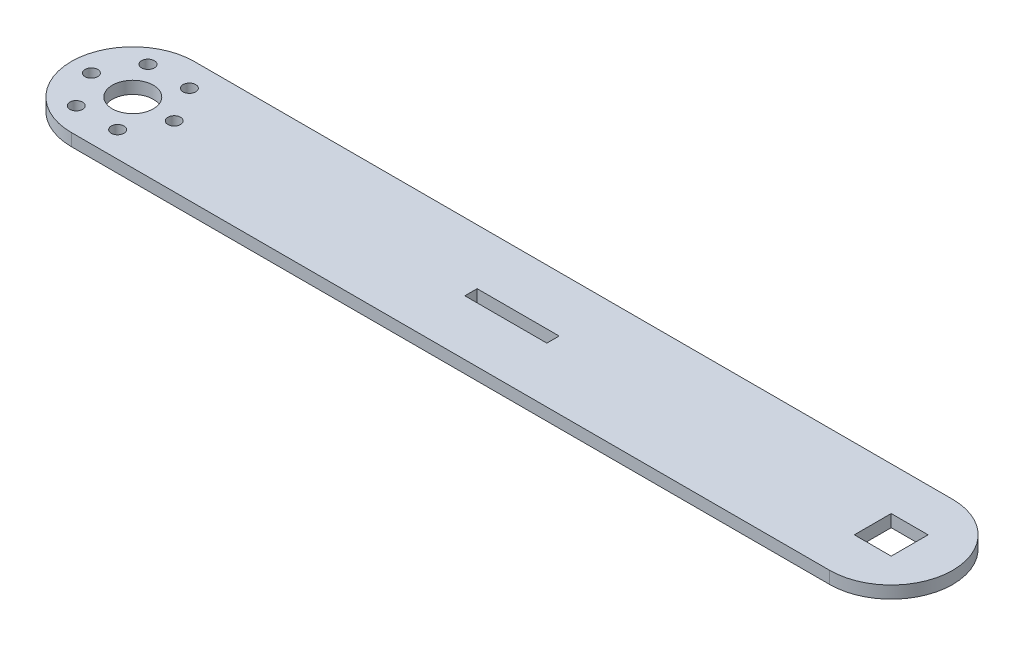
ISO-10303-21;
HEADER;
FILE_DESCRIPTION(('STEP AP214'),'2;1');
FILE_NAME('part.step','',(''),(''),'','','');
FILE_SCHEMA(('AUTOMOTIVE_DESIGN { 1 0 10303 214 1 1 1 1 }'));
ENDSEC;
DATA;
#1=APPLICATION_CONTEXT('core data for automotive mechanical design processes');
#2=APPLICATION_PROTOCOL_DEFINITION('international standard','automotive_design',2000,#1);
#3=PRODUCT_CONTEXT('',#1,'mechanical');
#4=PRODUCT('Part','Part','',(#3));
#5=PRODUCT_RELATED_PRODUCT_CATEGORY('part','',(#4));
#6=PRODUCT_DEFINITION_FORMATION('','',#4);
#7=PRODUCT_DEFINITION_CONTEXT('part definition',#1,'design');
#8=PRODUCT_DEFINITION('design','',#6,#7);
#9=PRODUCT_DEFINITION_SHAPE('','',#8);
#10=(LENGTH_UNIT() NAMED_UNIT(*) SI_UNIT(.MILLI.,.METRE.));
#11=(NAMED_UNIT(*) PLANE_ANGLE_UNIT() SI_UNIT($,.RADIAN.));
#12=(NAMED_UNIT(*) SI_UNIT($,.STERADIAN.) SOLID_ANGLE_UNIT());
#13=UNCERTAINTY_MEASURE_WITH_UNIT(LENGTH_MEASURE(1.E-05),#10,'distance_accuracy_value','');
#14=(GEOMETRIC_REPRESENTATION_CONTEXT(3) GLOBAL_UNCERTAINTY_ASSIGNED_CONTEXT((#13)) GLOBAL_UNIT_ASSIGNED_CONTEXT((#10,
#11,#12)) REPRESENTATION_CONTEXT('',''));
#15=CARTESIAN_POINT('',(0.,0.,0.));
#16=DIRECTION('',(0.,0.,1.));
#17=DIRECTION('',(1.,0.,0.));
#18=AXIS2_PLACEMENT_3D('',#15,#16,#17);
#19=CARTESIAN_POINT('',(0.,1.5,15.));
#20=DIRECTION('',(0.,0.,-1.));
#21=DIRECTION('',(-1.,0.,0.));
#22=AXIS2_PLACEMENT_3D('',#19,#20,#21);
#23=PLANE('',#22);
#24=DIRECTION('',(1.,0.,0.));
#25=VECTOR('',#24,1.);
#26=CARTESIAN_POINT('',(0.,-1.5,15.));
#27=LINE('',#26,#25);
#28=CARTESIAN_POINT('',(0.,-1.5,15.));
#29=VERTEX_POINT('',#28);
#30=CARTESIAN_POINT('',(185.,-1.5,15.));
#31=VERTEX_POINT('',#30);
#32=EDGE_CURVE('E207',#29,#31,#27,.T.);
#33=ORIENTED_EDGE('',*,*,#32,.T.);
#34=DIRECTION('',(0.,-1.,0.));
#35=VECTOR('',#34,1.);
#36=CARTESIAN_POINT('',(185.,1.5,15.));
#37=LINE('',#36,#35);
#38=CARTESIAN_POINT('',(185.,1.5,15.));
#39=VERTEX_POINT('',#38);
#40=EDGE_CURVE('E11',#39,#31,#37,.T.);
#41=ORIENTED_EDGE('',*,*,#40,.F.);
#42=DIRECTION('',(1.,0.,0.));
#43=VECTOR('',#42,1.);
#44=CARTESIAN_POINT('',(0.,1.5,15.));
#45=LINE('',#44,#43);
#46=CARTESIAN_POINT('',(0.,1.5,15.));
#47=VERTEX_POINT('',#46);
#48=EDGE_CURVE('E145',#47,#39,#45,.T.);
#49=ORIENTED_EDGE('',*,*,#48,.F.);
#50=DIRECTION('',(0.,-1.,0.));
#51=VECTOR('',#50,1.);
#52=CARTESIAN_POINT('',(0.,1.5,15.));
#53=LINE('',#52,#51);
#54=EDGE_CURVE('E60',#47,#29,#53,.T.);
#55=ORIENTED_EDGE('',*,*,#54,.T.);
#56=EDGE_LOOP('',(#33,#41,#49,#55));
#57=FACE_BOUND('',#56,.T.);
#58=ADVANCED_FACE('F41',(#57),#23,.F.);
#59=CARTESIAN_POINT('',(185.,1.5,0.));
#60=DIRECTION('',(0.,-1.,0.));
#61=DIRECTION('',(0.,0.,-1.));
#62=AXIS2_PLACEMENT_3D('',#59,#60,#61);
#63=CYLINDRICAL_SURFACE('',#62,15.);
#64=CARTESIAN_POINT('',(185.,-1.5,0.));
#65=DIRECTION('',(0.,1.,0.));
#66=DIRECTION('',(0.,0.,1.));
#67=AXIS2_PLACEMENT_3D('',#64,#65,#66);
#68=CIRCLE('',#67,15.);
#69=CARTESIAN_POINT('',(185.,-1.5,-15.));
#70=VERTEX_POINT('',#69);
#71=EDGE_CURVE('E151',#31,#70,#68,.T.);
#72=ORIENTED_EDGE('',*,*,#71,.T.);
#73=DIRECTION('',(0.,-1.,0.));
#74=VECTOR('',#73,1.);
#75=CARTESIAN_POINT('',(185.,1.5,-15.));
#76=LINE('',#75,#74);
#77=CARTESIAN_POINT('',(185.,1.5,-15.));
#78=VERTEX_POINT('',#77);
#79=EDGE_CURVE('E51',#78,#70,#76,.T.);
#80=ORIENTED_EDGE('',*,*,#79,.F.);
#81=CARTESIAN_POINT('',(185.,1.5,0.));
#82=DIRECTION('',(0.,1.,0.));
#83=DIRECTION('',(0.,0.,1.));
#84=AXIS2_PLACEMENT_3D('',#81,#82,#83);
#85=CIRCLE('',#84,15.);
#86=EDGE_CURVE('E139',#39,#78,#85,.T.);
#87=ORIENTED_EDGE('',*,*,#86,.F.);
#88=ORIENTED_EDGE('',*,*,#40,.T.);
#89=EDGE_LOOP('',(#72,#80,#87,#88));
#90=FACE_BOUND('',#89,.T.);
#91=ADVANCED_FACE('F150',(#90),#63,.T.);
#92=CARTESIAN_POINT('',(0.,1.5,-15.));
#93=DIRECTION('',(0.,0.,-1.));
#94=DIRECTION('',(-1.,0.,0.));
#95=AXIS2_PLACEMENT_3D('',#92,#93,#94);
#96=PLANE('',#95);
#97=DIRECTION('',(1.,0.,0.));
#98=VECTOR('',#97,1.);
#99=CARTESIAN_POINT('',(0.,-1.5,-15.));
#100=LINE('',#99,#98);
#101=CARTESIAN_POINT('',(0.,-1.5,-15.));
#102=VERTEX_POINT('',#101);
#103=EDGE_CURVE('E210',#102,#70,#100,.T.);
#104=ORIENTED_EDGE('',*,*,#103,.F.);
#105=DIRECTION('',(0.,-1.,0.));
#106=VECTOR('',#105,1.);
#107=CARTESIAN_POINT('',(0.,1.5,-15.));
#108=LINE('',#107,#106);
#109=CARTESIAN_POINT('',(0.,1.5,-15.));
#110=VERTEX_POINT('',#109);
#111=EDGE_CURVE('E98',#110,#102,#108,.T.);
#112=ORIENTED_EDGE('',*,*,#111,.F.);
#113=DIRECTION('',(1.,0.,0.));
#114=VECTOR('',#113,1.);
#115=CARTESIAN_POINT('',(0.,1.5,-15.));
#116=LINE('',#115,#114);
#117=EDGE_CURVE('E144',#110,#78,#116,.T.);
#118=ORIENTED_EDGE('',*,*,#117,.T.);
#119=ORIENTED_EDGE('',*,*,#79,.T.);
#120=EDGE_LOOP('',(#104,#112,#118,#119));
#121=FACE_BOUND('',#120,.T.);
#122=ADVANCED_FACE('F155',(#121),#96,.T.);
#123=CARTESIAN_POINT('',(102.5,1.5,0.));
#124=DIRECTION('',(-1.,0.,0.));
#125=DIRECTION('',(0.,0.,1.));
#126=AXIS2_PLACEMENT_3D('',#123,#124,#125);
#127=PLANE('',#126);
#128=DIRECTION('',(0.,0.,-1.));
#129=VECTOR('',#128,1.);
#130=CARTESIAN_POINT('',(102.5,-1.5,0.));
#131=LINE('',#130,#129);
#132=CARTESIAN_POINT('',(102.5,-1.5,1.5));
#133=VERTEX_POINT('',#132);
#134=CARTESIAN_POINT('',(102.5,-1.5,-1.5));
#135=VERTEX_POINT('',#134);
#136=EDGE_CURVE('E195',#133,#135,#131,.T.);
#137=ORIENTED_EDGE('',*,*,#136,.F.);
#138=DIRECTION('',(0.,-1.,0.));
#139=VECTOR('',#138,1.);
#140=CARTESIAN_POINT('',(102.5,1.5,1.5));
#141=LINE('',#140,#139);
#142=CARTESIAN_POINT('',(102.5,1.5,1.5));
#143=VERTEX_POINT('',#142);
#144=EDGE_CURVE('E217',#143,#133,#141,.T.);
#145=ORIENTED_EDGE('',*,*,#144,.F.);
#146=DIRECTION('',(0.,0.,-1.));
#147=VECTOR('',#146,1.);
#148=CARTESIAN_POINT('',(102.5,1.5,0.));
#149=LINE('',#148,#147);
#150=CARTESIAN_POINT('',(102.5,1.5,-1.5));
#151=VERTEX_POINT('',#150);
#152=EDGE_CURVE('E487',#143,#151,#149,.T.);
#153=ORIENTED_EDGE('',*,*,#152,.T.);
#154=DIRECTION('',(0.,-1.,0.));
#155=VECTOR('',#154,1.);
#156=CARTESIAN_POINT('',(102.5,1.5,-1.5));
#157=LINE('',#156,#155);
#158=EDGE_CURVE('E219',#151,#135,#157,.T.);
#159=ORIENTED_EDGE('',*,*,#158,.T.);
#160=EDGE_LOOP('',(#137,#145,#153,#159));
#161=FACE_BOUND('',#160,.T.);
#162=ADVANCED_FACE('F276',(#161),#127,.T.);
#163=CARTESIAN_POINT('',(0.,1.5,1.5));
#164=DIRECTION('',(0.,0.,-1.));
#165=DIRECTION('',(-1.,0.,0.));
#166=AXIS2_PLACEMENT_3D('',#163,#164,#165);
#167=PLANE('',#166);
#168=DIRECTION('',(1.,0.,0.));
#169=VECTOR('',#168,1.);
#170=CARTESIAN_POINT('',(0.,-1.5,1.5));
#171=LINE('',#170,#169);
#172=CARTESIAN_POINT('',(82.5,-1.5,1.5));
#173=VERTEX_POINT('',#172);
#174=EDGE_CURVE('E198',#173,#133,#171,.T.);
#175=ORIENTED_EDGE('',*,*,#174,.F.);
#176=DIRECTION('',(0.,-1.,0.));
#177=VECTOR('',#176,1.);
#178=CARTESIAN_POINT('',(82.5,1.5,1.5));
#179=LINE('',#178,#177);
#180=CARTESIAN_POINT('',(82.5,1.5,1.5));
#181=VERTEX_POINT('',#180);
#182=EDGE_CURVE('E224',#181,#173,#179,.T.);
#183=ORIENTED_EDGE('',*,*,#182,.F.);
#184=DIRECTION('',(1.,0.,0.));
#185=VECTOR('',#184,1.);
#186=CARTESIAN_POINT('',(0.,1.5,1.5));
#187=LINE('',#186,#185);
#188=EDGE_CURVE('E484',#181,#143,#187,.T.);
#189=ORIENTED_EDGE('',*,*,#188,.T.);
#190=ORIENTED_EDGE('',*,*,#144,.T.);
#191=EDGE_LOOP('',(#175,#183,#189,#190));
#192=FACE_BOUND('',#191,.T.);
#193=ADVANCED_FACE('F272',(#192),#167,.T.);
#194=CARTESIAN_POINT('',(82.5,1.5,0.));
#195=DIRECTION('',(-1.,0.,0.));
#196=DIRECTION('',(0.,0.,1.));
#197=AXIS2_PLACEMENT_3D('',#194,#195,#196);
#198=PLANE('',#197);
#199=DIRECTION('',(0.,0.,-1.));
#200=VECTOR('',#199,1.);
#201=CARTESIAN_POINT('',(82.5,-1.5,0.));
#202=LINE('',#201,#200);
#203=CARTESIAN_POINT('',(82.5,-1.5,-1.5));
#204=VERTEX_POINT('',#203);
#205=EDGE_CURVE('E201',#173,#204,#202,.T.);
#206=ORIENTED_EDGE('',*,*,#205,.T.);
#207=DIRECTION('',(0.,-1.,0.));
#208=VECTOR('',#207,1.);
#209=CARTESIAN_POINT('',(82.5,1.5,-1.5));
#210=LINE('',#209,#208);
#211=CARTESIAN_POINT('',(82.5,1.5,-1.5));
#212=VERTEX_POINT('',#211);
#213=EDGE_CURVE('E221',#212,#204,#210,.T.);
#214=ORIENTED_EDGE('',*,*,#213,.F.);
#215=DIRECTION('',(0.,0.,-1.));
#216=VECTOR('',#215,1.);
#217=CARTESIAN_POINT('',(82.5,1.5,0.));
#218=LINE('',#217,#216);
#219=EDGE_CURVE('E479',#181,#212,#218,.T.);
#220=ORIENTED_EDGE('',*,*,#219,.F.);
#221=ORIENTED_EDGE('',*,*,#182,.T.);
#222=EDGE_LOOP('',(#206,#214,#220,#221));
#223=FACE_BOUND('',#222,.T.);
#224=ADVANCED_FACE('F269',(#223),#198,.F.);
#225=CARTESIAN_POINT('',(0.,1.5,4.50000000000004));
#226=DIRECTION('',(0.,0.,1.));
#227=DIRECTION('',(1.,0.,0.));
#228=AXIS2_PLACEMENT_3D('',#225,#226,#227);
#229=PLANE('',#228);
#230=DIRECTION('',(-1.,0.,0.));
#231=VECTOR('',#230,1.);
#232=CARTESIAN_POINT('',(0.,-1.5,4.50000000000004));
#233=LINE('',#232,#231);
#234=CARTESIAN_POINT('',(189.5,-1.5,4.5));
#235=VERTEX_POINT('',#234);
#236=CARTESIAN_POINT('',(180.5,-1.5,4.5));
#237=VERTEX_POINT('',#236);
#238=EDGE_CURVE('E183',#235,#237,#233,.T.);
#239=ORIENTED_EDGE('',*,*,#238,.T.);
#240=DIRECTION('',(0.,-1.,0.));
#241=VECTOR('',#240,1.);
#242=CARTESIAN_POINT('',(180.5,1.5,4.5));
#243=LINE('',#242,#241);
#244=CARTESIAN_POINT('',(180.5,1.5,4.5));
#245=VERTEX_POINT('',#244);
#246=EDGE_CURVE('E45',#245,#237,#243,.T.);
#247=ORIENTED_EDGE('',*,*,#246,.F.);
#248=DIRECTION('',(-1.,0.,0.));
#249=VECTOR('',#248,1.);
#250=CARTESIAN_POINT('',(0.,1.5,4.50000000000004));
#251=LINE('',#250,#249);
#252=CARTESIAN_POINT('',(189.5,1.5,4.5));
#253=VERTEX_POINT('',#252);
#254=EDGE_CURVE('E494',#253,#245,#251,.T.);
#255=ORIENTED_EDGE('',*,*,#254,.F.);
#256=DIRECTION('',(0.,-1.,0.));
#257=VECTOR('',#256,1.);
#258=CARTESIAN_POINT('',(189.5,1.5,4.5));
#259=LINE('',#258,#257);
#260=EDGE_CURVE('E158',#253,#235,#259,.T.);
#261=ORIENTED_EDGE('',*,*,#260,.T.);
#262=EDGE_LOOP('',(#239,#247,#255,#261));
#263=FACE_BOUND('',#262,.T.);
#264=ADVANCED_FACE('F238',(#263),#229,.F.);
#265=CARTESIAN_POINT('',(180.5,1.5,0.));
#266=DIRECTION('',(-1.,0.,0.));
#267=DIRECTION('',(0.,0.,1.));
#268=AXIS2_PLACEMENT_3D('',#265,#266,#267);
#269=PLANE('',#268);
#270=DIRECTION('',(0.,0.,-1.));
#271=VECTOR('',#270,1.);
#272=CARTESIAN_POINT('',(180.5,-1.5,0.));
#273=LINE('',#272,#271);
#274=CARTESIAN_POINT('',(180.5,-1.5,-4.5));
#275=VERTEX_POINT('',#274);
#276=EDGE_CURVE('E186',#237,#275,#273,.T.);
#277=ORIENTED_EDGE('',*,*,#276,.T.);
#278=DIRECTION('',(0.,-1.,0.));
#279=VECTOR('',#278,1.);
#280=CARTESIAN_POINT('',(180.5,1.5,-4.5));
#281=LINE('',#280,#279);
#282=CARTESIAN_POINT('',(180.5,1.5,-4.5));
#283=VERTEX_POINT('',#282);
#284=EDGE_CURVE('E229',#283,#275,#281,.T.);
#285=ORIENTED_EDGE('',*,*,#284,.F.);
#286=DIRECTION('',(0.,0.,-1.));
#287=VECTOR('',#286,1.);
#288=CARTESIAN_POINT('',(180.5,1.5,0.));
#289=LINE('',#288,#287);
#290=EDGE_CURVE('E111',#245,#283,#289,.T.);
#291=ORIENTED_EDGE('',*,*,#290,.F.);
#292=ORIENTED_EDGE('',*,*,#246,.T.);
#293=EDGE_LOOP('',(#277,#285,#291,#292));
#294=FACE_BOUND('',#293,.T.);
#295=ADVANCED_FACE('F234',(#294),#269,.F.);
#296=CARTESIAN_POINT('',(0.,1.5,-4.49999999999996));
#297=DIRECTION('',(0.,0.,1.));
#298=DIRECTION('',(1.,0.,0.));
#299=AXIS2_PLACEMENT_3D('',#296,#297,#298);
#300=PLANE('',#299);
#301=DIRECTION('',(-1.,0.,0.));
#302=VECTOR('',#301,1.);
#303=CARTESIAN_POINT('',(0.,-1.5,-4.49999999999996));
#304=LINE('',#303,#302);
#305=CARTESIAN_POINT('',(189.5,-1.5,-4.5));
#306=VERTEX_POINT('',#305);
#307=EDGE_CURVE('E189',#306,#275,#304,.T.);
#308=ORIENTED_EDGE('',*,*,#307,.F.);
#309=DIRECTION('',(0.,-1.,0.));
#310=VECTOR('',#309,1.);
#311=CARTESIAN_POINT('',(189.5,1.5,-4.5));
#312=LINE('',#311,#310);
#313=CARTESIAN_POINT('',(189.5,1.5,-4.5));
#314=VERTEX_POINT('',#313);
#315=EDGE_CURVE('E228',#314,#306,#312,.T.);
#316=ORIENTED_EDGE('',*,*,#315,.F.);
#317=DIRECTION('',(-1.,0.,0.));
#318=VECTOR('',#317,1.);
#319=CARTESIAN_POINT('',(0.,1.5,-4.49999999999996));
#320=LINE('',#319,#318);
#321=EDGE_CURVE('E491',#314,#283,#320,.T.);
#322=ORIENTED_EDGE('',*,*,#321,.T.);
#323=ORIENTED_EDGE('',*,*,#284,.T.);
#324=EDGE_LOOP('',(#308,#316,#322,#323));
#325=FACE_BOUND('',#324,.T.);
#326=ADVANCED_FACE('F249',(#325),#300,.T.);
#327=CARTESIAN_POINT('',(0.,1.5,-1.5));
#328=DIRECTION('',(0.,0.,-1.));
#329=DIRECTION('',(-1.,0.,0.));
#330=AXIS2_PLACEMENT_3D('',#327,#328,#329);
#331=PLANE('',#330);
#332=DIRECTION('',(1.,0.,0.));
#333=VECTOR('',#332,1.);
#334=CARTESIAN_POINT('',(0.,-1.5,-1.5));
#335=LINE('',#334,#333);
#336=EDGE_CURVE('E204',#204,#135,#335,.T.);
#337=ORIENTED_EDGE('',*,*,#336,.T.);
#338=ORIENTED_EDGE('',*,*,#158,.F.);
#339=DIRECTION('',(1.,0.,0.));
#340=VECTOR('',#339,1.);
#341=CARTESIAN_POINT('',(0.,1.5,-1.5));
#342=LINE('',#341,#340);
#343=EDGE_CURVE('E478',#212,#151,#342,.T.);
#344=ORIENTED_EDGE('',*,*,#343,.F.);
#345=ORIENTED_EDGE('',*,*,#213,.T.);
#346=EDGE_LOOP('',(#337,#338,#344,#345));
#347=FACE_BOUND('',#346,.T.);
#348=ADVANCED_FACE('F251',(#347),#331,.F.);
#349=CARTESIAN_POINT('',(189.5,1.5,0.));
#350=DIRECTION('',(-1.,0.,0.));
#351=DIRECTION('',(0.,0.,1.));
#352=AXIS2_PLACEMENT_3D('',#349,#350,#351);
#353=PLANE('',#352);
#354=DIRECTION('',(0.,0.,-1.));
#355=VECTOR('',#354,1.);
#356=CARTESIAN_POINT('',(189.5,-1.5,0.));
#357=LINE('',#356,#355);
#358=EDGE_CURVE('E192',#235,#306,#357,.T.);
#359=ORIENTED_EDGE('',*,*,#358,.F.);
#360=ORIENTED_EDGE('',*,*,#260,.F.);
#361=DIRECTION('',(0.,0.,-1.));
#362=VECTOR('',#361,1.);
#363=CARTESIAN_POINT('',(189.5,1.5,0.));
#364=LINE('',#363,#362);
#365=EDGE_CURVE('E247',#253,#314,#364,.T.);
#366=ORIENTED_EDGE('',*,*,#365,.T.);
#367=ORIENTED_EDGE('',*,*,#315,.T.);
#368=EDGE_LOOP('',(#359,#360,#366,#367));
#369=FACE_BOUND('',#368,.T.);
#370=ADVANCED_FACE('F244',(#369),#353,.T.);
#371=CARTESIAN_POINT('',(0.,1.5,0.));
#372=DIRECTION('',(0.,-1.,0.));
#373=DIRECTION('',(0.,0.,-1.));
#374=AXIS2_PLACEMENT_3D('',#371,#372,#373);
#375=CYLINDRICAL_SURFACE('',#374,5.);
#376=CARTESIAN_POINT('',(0.,1.5,0.));
#377=DIRECTION('',(0.,1.,0.));
#378=DIRECTION('',(0.,0.,1.));
#379=AXIS2_PLACEMENT_3D('',#376,#377,#378);
#380=CIRCLE('',#379,5.);
#381=CARTESIAN_POINT('',(0.,1.5,5.));
#382=VERTEX_POINT('',#381);
#383=EDGE_CURVE('E496',#382,#382,#380,.T.);
#384=ORIENTED_EDGE('',*,*,#383,.T.);
#385=EDGE_LOOP('',(#384));
#386=FACE_BOUND('',#385,.T.);
#387=CARTESIAN_POINT('',(0.,-1.5,0.));
#388=DIRECTION('',(0.,1.,0.));
#389=DIRECTION('',(0.,0.,1.));
#390=AXIS2_PLACEMENT_3D('',#387,#388,#389);
#391=CIRCLE('',#390,5.);
#392=CARTESIAN_POINT('',(0.,-1.5,5.));
#393=VERTEX_POINT('',#392);
#394=EDGE_CURVE('E180',#393,#393,#391,.T.);
#395=ORIENTED_EDGE('',*,*,#394,.F.);
#396=EDGE_LOOP('',(#395));
#397=FACE_BOUND('',#396,.T.);
#398=ADVANCED_FACE('F281',(#386,#397),#375,.F.);
#399=CARTESIAN_POINT('',(5.05181485540923,1.5,-8.75));
#400=DIRECTION('',(0.,-1.,0.));
#401=DIRECTION('',(0.,0.,-1.));
#402=AXIS2_PLACEMENT_3D('',#399,#400,#401);
#403=CYLINDRICAL_SURFACE('',#402,1.55);
#404=CARTESIAN_POINT('',(5.05181485540923,1.5,-8.75));
#405=DIRECTION('',(0.,1.,0.));
#406=DIRECTION('',(0.,0.,1.));
#407=AXIS2_PLACEMENT_3D('',#404,#405,#406);
#408=CIRCLE('',#407,1.55);
#409=CARTESIAN_POINT('',(5.05181485540923,1.5,-7.2));
#410=VERTEX_POINT('',#409);
#411=EDGE_CURVE('E498',#410,#410,#408,.T.);
#412=ORIENTED_EDGE('',*,*,#411,.T.);
#413=EDGE_LOOP('',(#412));
#414=FACE_BOUND('',#413,.T.);
#415=CARTESIAN_POINT('',(5.05181485540923,-1.5,-8.75));
#416=DIRECTION('',(0.,1.,0.));
#417=DIRECTION('',(0.,0.,1.));
#418=AXIS2_PLACEMENT_3D('',#415,#416,#417);
#419=CIRCLE('',#418,1.55);
#420=CARTESIAN_POINT('',(5.05181485540923,-1.5,-7.2));
#421=VERTEX_POINT('',#420);
#422=EDGE_CURVE('E177',#421,#421,#419,.T.);
#423=ORIENTED_EDGE('',*,*,#422,.F.);
#424=EDGE_LOOP('',(#423));
#425=FACE_BOUND('',#424,.T.);
#426=ADVANCED_FACE('F285',(#414,#425),#403,.F.);
#427=CARTESIAN_POINT('',(10.1036297108185,1.5,0.));
#428=DIRECTION('',(0.,-1.,0.));
#429=DIRECTION('',(0.,0.,-1.));
#430=AXIS2_PLACEMENT_3D('',#427,#428,#429);
#431=CYLINDRICAL_SURFACE('',#430,1.55);
#432=CARTESIAN_POINT('',(10.1036297108185,1.5,0.));
#433=DIRECTION('',(0.,1.,0.));
#434=DIRECTION('',(0.,0.,1.));
#435=AXIS2_PLACEMENT_3D('',#432,#433,#434);
#436=CIRCLE('',#435,1.55);
#437=CARTESIAN_POINT('',(10.1036297108185,1.5,1.55));
#438=VERTEX_POINT('',#437);
#439=EDGE_CURVE('E501',#438,#438,#436,.T.);
#440=ORIENTED_EDGE('',*,*,#439,.T.);
#441=EDGE_LOOP('',(#440));
#442=FACE_BOUND('',#441,.T.);
#443=CARTESIAN_POINT('',(10.1036297108185,-1.5,0.));
#444=DIRECTION('',(0.,1.,0.));
#445=DIRECTION('',(0.,0.,1.));
#446=AXIS2_PLACEMENT_3D('',#443,#444,#445);
#447=CIRCLE('',#446,1.55);
#448=CARTESIAN_POINT('',(10.1036297108185,-1.5,1.55));
#449=VERTEX_POINT('',#448);
#450=EDGE_CURVE('E174',#449,#449,#447,.T.);
#451=ORIENTED_EDGE('',*,*,#450,.F.);
#452=EDGE_LOOP('',(#451));
#453=FACE_BOUND('',#452,.T.);
#454=ADVANCED_FACE('F291',(#442,#453),#431,.F.);
#455=CARTESIAN_POINT('',(5.05181485540923,1.5,8.75));
#456=DIRECTION('',(0.,-1.,0.));
#457=DIRECTION('',(0.,0.,-1.));
#458=AXIS2_PLACEMENT_3D('',#455,#456,#457);
#459=CYLINDRICAL_SURFACE('',#458,1.55);
#460=CARTESIAN_POINT('',(5.05181485540923,1.5,8.75));
#461=DIRECTION('',(0.,1.,0.));
#462=DIRECTION('',(0.,0.,1.));
#463=AXIS2_PLACEMENT_3D('',#460,#461,#462);
#464=CIRCLE('',#463,1.55);
#465=CARTESIAN_POINT('',(5.05181485540923,1.5,10.3));
#466=VERTEX_POINT('',#465);
#467=EDGE_CURVE('E504',#466,#466,#464,.T.);
#468=ORIENTED_EDGE('',*,*,#467,.T.);
#469=EDGE_LOOP('',(#468));
#470=FACE_BOUND('',#469,.T.);
#471=CARTESIAN_POINT('',(5.05181485540923,-1.5,8.75));
#472=DIRECTION('',(0.,1.,0.));
#473=DIRECTION('',(0.,0.,1.));
#474=AXIS2_PLACEMENT_3D('',#471,#472,#473);
#475=CIRCLE('',#474,1.55);
#476=CARTESIAN_POINT('',(5.05181485540923,-1.5,10.3));
#477=VERTEX_POINT('',#476);
#478=EDGE_CURVE('E171',#477,#477,#475,.T.);
#479=ORIENTED_EDGE('',*,*,#478,.F.);
#480=EDGE_LOOP('',(#479));
#481=FACE_BOUND('',#480,.T.);
#482=ADVANCED_FACE('F300',(#470,#481),#459,.F.);
#483=CARTESIAN_POINT('',(-5.05181485540923,1.5,8.75));
#484=DIRECTION('',(0.,-1.,0.));
#485=DIRECTION('',(0.,0.,-1.));
#486=AXIS2_PLACEMENT_3D('',#483,#484,#485);
#487=CYLINDRICAL_SURFACE('',#486,1.55);
#488=CARTESIAN_POINT('',(-5.05181485540923,1.5,8.75));
#489=DIRECTION('',(0.,1.,0.));
#490=DIRECTION('',(0.,0.,1.));
#491=AXIS2_PLACEMENT_3D('',#488,#489,#490);
#492=CIRCLE('',#491,1.55);
#493=CARTESIAN_POINT('',(-5.05181485540923,1.5,10.3));
#494=VERTEX_POINT('',#493);
#495=EDGE_CURVE('E507',#494,#494,#492,.T.);
#496=ORIENTED_EDGE('',*,*,#495,.T.);
#497=EDGE_LOOP('',(#496));
#498=FACE_BOUND('',#497,.T.);
#499=CARTESIAN_POINT('',(-5.05181485540923,-1.5,8.75));
#500=DIRECTION('',(0.,1.,0.));
#501=DIRECTION('',(0.,0.,1.));
#502=AXIS2_PLACEMENT_3D('',#499,#500,#501);
#503=CIRCLE('',#502,1.55);
#504=CARTESIAN_POINT('',(-5.05181485540923,-1.5,10.3));
#505=VERTEX_POINT('',#504);
#506=EDGE_CURVE('E168',#505,#505,#503,.T.);
#507=ORIENTED_EDGE('',*,*,#506,.F.);
#508=EDGE_LOOP('',(#507));
#509=FACE_BOUND('',#508,.T.);
#510=ADVANCED_FACE('F304',(#498,#509),#487,.F.);
#511=CARTESIAN_POINT('',(-10.1036297108185,1.5,0.));
#512=DIRECTION('',(0.,-1.,0.));
#513=DIRECTION('',(0.,0.,-1.));
#514=AXIS2_PLACEMENT_3D('',#511,#512,#513);
#515=CYLINDRICAL_SURFACE('',#514,1.55);
#516=CARTESIAN_POINT('',(-10.1036297108185,1.5,0.));
#517=DIRECTION('',(0.,1.,0.));
#518=DIRECTION('',(0.,0.,1.));
#519=AXIS2_PLACEMENT_3D('',#516,#517,#518);
#520=CIRCLE('',#519,1.55);
#521=CARTESIAN_POINT('',(-10.1036297108185,1.5,1.55));
#522=VERTEX_POINT('',#521);
#523=EDGE_CURVE('E319',#522,#522,#520,.T.);
#524=ORIENTED_EDGE('',*,*,#523,.T.);
#525=EDGE_LOOP('',(#524));
#526=FACE_BOUND('',#525,.T.);
#527=CARTESIAN_POINT('',(-10.1036297108185,-1.5,0.));
#528=DIRECTION('',(0.,1.,0.));
#529=DIRECTION('',(0.,0.,1.));
#530=AXIS2_PLACEMENT_3D('',#527,#528,#529);
#531=CIRCLE('',#530,1.55);
#532=CARTESIAN_POINT('',(-10.1036297108185,-1.5,1.55));
#533=VERTEX_POINT('',#532);
#534=EDGE_CURVE('E165',#533,#533,#531,.T.);
#535=ORIENTED_EDGE('',*,*,#534,.F.);
#536=EDGE_LOOP('',(#535));
#537=FACE_BOUND('',#536,.T.);
#538=ADVANCED_FACE('F307',(#526,#537),#515,.F.);
#539=CARTESIAN_POINT('',(-5.05181485540923,1.5,-8.75));
#540=DIRECTION('',(0.,-1.,0.));
#541=DIRECTION('',(0.,0.,-1.));
#542=AXIS2_PLACEMENT_3D('',#539,#540,#541);
#543=CYLINDRICAL_SURFACE('',#542,1.55);
#544=CARTESIAN_POINT('',(-5.05181485540923,1.5,-8.75));
#545=DIRECTION('',(0.,1.,0.));
#546=DIRECTION('',(0.,0.,1.));
#547=AXIS2_PLACEMENT_3D('',#544,#545,#546);
#548=CIRCLE('',#547,1.55);
#549=CARTESIAN_POINT('',(-5.05181485540923,1.5,-7.2));
#550=VERTEX_POINT('',#549);
#551=EDGE_CURVE('E215',#550,#550,#548,.T.);
#552=ORIENTED_EDGE('',*,*,#551,.T.);
#553=EDGE_LOOP('',(#552));
#554=FACE_BOUND('',#553,.T.);
#555=CARTESIAN_POINT('',(-5.05181485540923,-1.5,-8.75));
#556=DIRECTION('',(0.,1.,0.));
#557=DIRECTION('',(0.,0.,1.));
#558=AXIS2_PLACEMENT_3D('',#555,#556,#557);
#559=CIRCLE('',#558,1.55);
#560=CARTESIAN_POINT('',(-5.05181485540923,-1.5,-7.2));
#561=VERTEX_POINT('',#560);
#562=EDGE_CURVE('E162',#561,#561,#559,.T.);
#563=ORIENTED_EDGE('',*,*,#562,.F.);
#564=EDGE_LOOP('',(#563));
#565=FACE_BOUND('',#564,.T.);
#566=ADVANCED_FACE('F43',(#554,#565),#543,.F.);
#567=CARTESIAN_POINT('',(0.,1.5,0.));
#568=DIRECTION('',(0.,-1.,0.));
#569=DIRECTION('',(0.,0.,-1.));
#570=AXIS2_PLACEMENT_3D('',#567,#568,#569);
#571=CYLINDRICAL_SURFACE('',#570,15.);
#572=CARTESIAN_POINT('',(0.,-1.5,0.));
#573=DIRECTION('',(0.,1.,0.));
#574=DIRECTION('',(0.,0.,1.));
#575=AXIS2_PLACEMENT_3D('',#572,#573,#574);
#576=CIRCLE('',#575,15.);
#577=EDGE_CURVE('E212',#29,#102,#576,.F.);
#578=ORIENTED_EDGE('',*,*,#577,.F.);
#579=ORIENTED_EDGE('',*,*,#54,.F.);
#580=CARTESIAN_POINT('',(0.,1.5,0.));
#581=DIRECTION('',(0.,1.,0.));
#582=DIRECTION('',(0.,0.,1.));
#583=AXIS2_PLACEMENT_3D('',#580,#581,#582);
#584=CIRCLE('',#583,15.);
#585=EDGE_CURVE('E156',#47,#110,#584,.F.);
#586=ORIENTED_EDGE('',*,*,#585,.T.);
#587=ORIENTED_EDGE('',*,*,#111,.T.);
#588=EDGE_LOOP('',(#578,#579,#586,#587));
#589=FACE_BOUND('',#588,.T.);
#590=ADVANCED_FACE('F314',(#589),#571,.T.);
#591=CARTESIAN_POINT('',(0.,1.5,0.));
#592=DIRECTION('',(0.,1.,0.));
#593=DIRECTION('',(0.,0.,1.));
#594=AXIS2_PLACEMENT_3D('',#591,#592,#593);
#595=PLANE('',#594);
#596=ORIENTED_EDGE('',*,*,#551,.F.);
#597=EDGE_LOOP('',(#596));
#598=FACE_BOUND('',#597,.T.);
#599=ORIENTED_EDGE('',*,*,#523,.F.);
#600=EDGE_LOOP('',(#599));
#601=FACE_BOUND('',#600,.T.);
#602=ORIENTED_EDGE('',*,*,#495,.F.);
#603=EDGE_LOOP('',(#602));
#604=FACE_BOUND('',#603,.T.);
#605=ORIENTED_EDGE('',*,*,#467,.F.);
#606=EDGE_LOOP('',(#605));
#607=FACE_BOUND('',#606,.T.);
#608=ORIENTED_EDGE('',*,*,#439,.F.);
#609=EDGE_LOOP('',(#608));
#610=FACE_BOUND('',#609,.T.);
#611=ORIENTED_EDGE('',*,*,#411,.F.);
#612=EDGE_LOOP('',(#611));
#613=FACE_BOUND('',#612,.T.);
#614=ORIENTED_EDGE('',*,*,#383,.F.);
#615=EDGE_LOOP('',(#614));
#616=FACE_BOUND('',#615,.T.);
#617=ORIENTED_EDGE('',*,*,#254,.T.);
#618=ORIENTED_EDGE('',*,*,#290,.T.);
#619=ORIENTED_EDGE('',*,*,#321,.F.);
#620=ORIENTED_EDGE('',*,*,#365,.F.);
#621=EDGE_LOOP('',(#617,#618,#619,#620));
#622=FACE_BOUND('',#621,.T.);
#623=ORIENTED_EDGE('',*,*,#152,.F.);
#624=ORIENTED_EDGE('',*,*,#188,.F.);
#625=ORIENTED_EDGE('',*,*,#219,.T.);
#626=ORIENTED_EDGE('',*,*,#343,.T.);
#627=EDGE_LOOP('',(#623,#624,#625,#626));
#628=FACE_BOUND('',#627,.T.);
#629=ORIENTED_EDGE('',*,*,#48,.T.);
#630=ORIENTED_EDGE('',*,*,#86,.T.);
#631=ORIENTED_EDGE('',*,*,#117,.F.);
#632=ORIENTED_EDGE('',*,*,#585,.F.);
#633=EDGE_LOOP('',(#629,#630,#631,#632));
#634=FACE_BOUND('',#633,.T.);
#635=ADVANCED_FACE('F141',(#598,#601,#604,#607,#610,#613,#616,#622,#628,#634),#595,.T.);
#636=CARTESIAN_POINT('',(0.,-1.5,0.));
#637=DIRECTION('',(0.,1.,0.));
#638=DIRECTION('',(0.,0.,1.));
#639=AXIS2_PLACEMENT_3D('',#636,#637,#638);
#640=PLANE('',#639);
#641=ORIENTED_EDGE('',*,*,#562,.T.);
#642=EDGE_LOOP('',(#641));
#643=FACE_BOUND('',#642,.T.);
#644=ORIENTED_EDGE('',*,*,#534,.T.);
#645=EDGE_LOOP('',(#644));
#646=FACE_BOUND('',#645,.T.);
#647=ORIENTED_EDGE('',*,*,#506,.T.);
#648=EDGE_LOOP('',(#647));
#649=FACE_BOUND('',#648,.T.);
#650=ORIENTED_EDGE('',*,*,#478,.T.);
#651=EDGE_LOOP('',(#650));
#652=FACE_BOUND('',#651,.T.);
#653=ORIENTED_EDGE('',*,*,#450,.T.);
#654=EDGE_LOOP('',(#653));
#655=FACE_BOUND('',#654,.T.);
#656=ORIENTED_EDGE('',*,*,#422,.T.);
#657=EDGE_LOOP('',(#656));
#658=FACE_BOUND('',#657,.T.);
#659=ORIENTED_EDGE('',*,*,#394,.T.);
#660=EDGE_LOOP('',(#659));
#661=FACE_BOUND('',#660,.T.);
#662=ORIENTED_EDGE('',*,*,#238,.F.);
#663=ORIENTED_EDGE('',*,*,#358,.T.);
#664=ORIENTED_EDGE('',*,*,#307,.T.);
#665=ORIENTED_EDGE('',*,*,#276,.F.);
#666=EDGE_LOOP('',(#662,#663,#664,#665));
#667=FACE_BOUND('',#666,.T.);
#668=ORIENTED_EDGE('',*,*,#136,.T.);
#669=ORIENTED_EDGE('',*,*,#336,.F.);
#670=ORIENTED_EDGE('',*,*,#205,.F.);
#671=ORIENTED_EDGE('',*,*,#174,.T.);
#672=EDGE_LOOP('',(#668,#669,#670,#671));
#673=FACE_BOUND('',#672,.T.);
#674=ORIENTED_EDGE('',*,*,#32,.F.);
#675=ORIENTED_EDGE('',*,*,#577,.T.);
#676=ORIENTED_EDGE('',*,*,#103,.T.);
#677=ORIENTED_EDGE('',*,*,#71,.F.);
#678=EDGE_LOOP('',(#674,#675,#676,#677));
#679=FACE_BOUND('',#678,.T.);
#680=ADVANCED_FACE('F241',(#643,#646,#649,#652,#655,#658,#661,#667,#673,#679),#640,.F.);
#681=CLOSED_SHELL('',(#58,#91,#122,#162,#193,#224,#264,#295,#326,#348,#370,#398,#426,#454,#482,
#510,#538,#566,#590,#635,#680));
#682=MANIFOLD_SOLID_BREP('B2',#681);
#683=ADVANCED_BREP_SHAPE_REPRESENTATION('',(#18,#682),#14);
#684=SHAPE_DEFINITION_REPRESENTATION(#9,#683);
ENDSEC;
END-ISO-10303-21;
